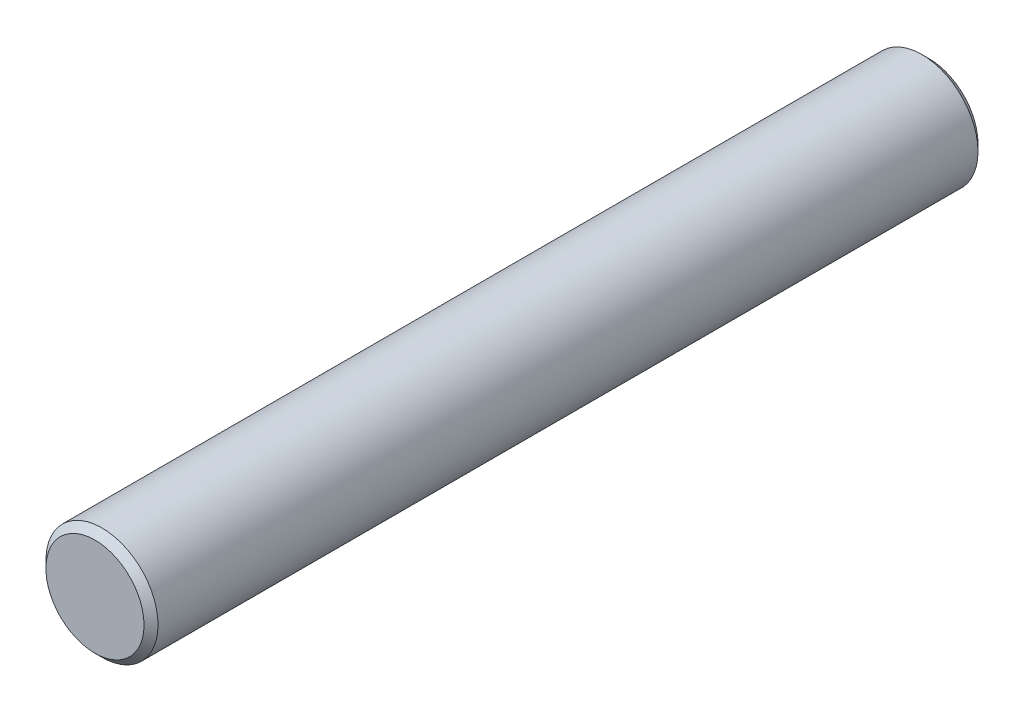
ISO-10303-21;
HEADER;
FILE_DESCRIPTION(('STEP AP214'),'2;1');
FILE_NAME('part.step','',(''),(''),'','','');
FILE_SCHEMA(('AUTOMOTIVE_DESIGN { 1 0 10303 214 1 1 1 1 }'));
ENDSEC;
DATA;
#1=APPLICATION_CONTEXT('core data for automotive mechanical design processes');
#2=APPLICATION_PROTOCOL_DEFINITION('international standard','automotive_design',2000,#1);
#3=PRODUCT_CONTEXT('',#1,'mechanical');
#4=PRODUCT('Part','Part','',(#3));
#5=PRODUCT_RELATED_PRODUCT_CATEGORY('part','',(#4));
#6=PRODUCT_DEFINITION_FORMATION('','',#4);
#7=PRODUCT_DEFINITION_CONTEXT('part definition',#1,'design');
#8=PRODUCT_DEFINITION('design','',#6,#7);
#9=PRODUCT_DEFINITION_SHAPE('','',#8);
#10=(LENGTH_UNIT() NAMED_UNIT(*) SI_UNIT(.MILLI.,.METRE.));
#11=(NAMED_UNIT(*) PLANE_ANGLE_UNIT() SI_UNIT($,.RADIAN.));
#12=(NAMED_UNIT(*) SI_UNIT($,.STERADIAN.) SOLID_ANGLE_UNIT());
#13=UNCERTAINTY_MEASURE_WITH_UNIT(LENGTH_MEASURE(1.E-05),#10,'distance_accuracy_value','');
#14=(GEOMETRIC_REPRESENTATION_CONTEXT(3) GLOBAL_UNCERTAINTY_ASSIGNED_CONTEXT((#13)) GLOBAL_UNIT_ASSIGNED_CONTEXT((#10,
#11,#12)) REPRESENTATION_CONTEXT('',''));
#15=CARTESIAN_POINT('',(0.,0.,0.));
#16=DIRECTION('',(0.,0.,1.));
#17=DIRECTION('',(1.,0.,0.));
#18=AXIS2_PLACEMENT_3D('',#15,#16,#17);
#19=CARTESIAN_POINT('',(0.,0.,59.5));
#20=DIRECTION('',(0.,0.,-1.));
#21=DIRECTION('',(-1.,0.,0.));
#22=AXIS2_PLACEMENT_3D('',#19,#20,#21);
#23=CYLINDRICAL_SURFACE('',#22,8.);
#24=CARTESIAN_POINT('',(0.,0.,-58.5));
#25=DIRECTION('',(0.,0.,1.));
#26=DIRECTION('',(1.,0.,0.));
#27=AXIS2_PLACEMENT_3D('',#24,#25,#26);
#28=CIRCLE('',#27,8.);
#29=CARTESIAN_POINT('',(8.,0.,-58.5));
#30=VERTEX_POINT('',#29);
#31=EDGE_CURVE('E50',#30,#30,#28,.T.);
#32=ORIENTED_EDGE('',*,*,#31,.T.);
#33=EDGE_LOOP('',(#32));
#34=FACE_BOUND('',#33,.T.);
#35=CARTESIAN_POINT('',(0.,0.,58.5));
#36=DIRECTION('',(0.,0.,1.));
#37=DIRECTION('',(1.,0.,0.));
#38=AXIS2_PLACEMENT_3D('',#35,#36,#37);
#39=CIRCLE('',#38,8.);
#40=CARTESIAN_POINT('',(8.,0.,58.5));
#41=VERTEX_POINT('',#40);
#42=EDGE_CURVE('E55',#41,#41,#39,.F.);
#43=ORIENTED_EDGE('',*,*,#42,.T.);
#44=EDGE_LOOP('',(#43));
#45=FACE_BOUND('',#44,.T.);
#46=ADVANCED_FACE('F37',(#34,#45),#23,.T.);
#47=CARTESIAN_POINT('',(0.,0.,59.5));
#48=DIRECTION('',(0.,0.,1.));
#49=DIRECTION('',(1.,0.,0.));
#50=AXIS2_PLACEMENT_3D('',#47,#48,#49);
#51=PLANE('',#50);
#52=CARTESIAN_POINT('',(0.,0.,59.5));
#53=DIRECTION('',(0.,0.,1.));
#54=DIRECTION('',(1.,0.,0.));
#55=AXIS2_PLACEMENT_3D('',#52,#53,#54);
#56=CIRCLE('',#55,6.99999999999998);
#57=CARTESIAN_POINT('',(6.99999999999998,0.,59.5));
#58=VERTEX_POINT('',#57);
#59=EDGE_CURVE('E10',#58,#58,#56,.T.);
#60=ORIENTED_EDGE('',*,*,#59,.T.);
#61=EDGE_LOOP('',(#60));
#62=FACE_BOUND('',#61,.T.);
#63=ADVANCED_FACE('F72',(#62),#51,.T.);
#64=CARTESIAN_POINT('',(0.,0.,-59.5));
#65=DIRECTION('',(0.,0.,1.));
#66=DIRECTION('',(1.,0.,0.));
#67=AXIS2_PLACEMENT_3D('',#64,#65,#66);
#68=PLANE('',#67);
#69=CARTESIAN_POINT('',(0.,0.,-59.5));
#70=DIRECTION('',(0.,0.,1.));
#71=DIRECTION('',(1.,0.,0.));
#72=AXIS2_PLACEMENT_3D('',#69,#70,#71);
#73=CIRCLE('',#72,7.00000000000002);
#74=CARTESIAN_POINT('',(7.00000000000002,0.,-59.5));
#75=VERTEX_POINT('',#74);
#76=EDGE_CURVE('E45',#75,#75,#73,.F.);
#77=ORIENTED_EDGE('',*,*,#76,.T.);
#78=EDGE_LOOP('',(#77));
#79=FACE_BOUND('',#78,.T.);
#80=ADVANCED_FACE('F69',(#79),#68,.F.);
#81=CARTESIAN_POINT('',(0.,0.,-58.5));
#82=DIRECTION('',(0.,0.,1.));
#83=DIRECTION('',(1.,0.,0.));
#84=AXIS2_PLACEMENT_3D('',#81,#82,#83);
#85=CONICAL_SURFACE('',#84,8.,0.785398163397452);
#86=ORIENTED_EDGE('',*,*,#76,.F.);
#87=EDGE_LOOP('',(#86));
#88=FACE_BOUND('',#87,.T.);
#89=ORIENTED_EDGE('',*,*,#31,.F.);
#90=EDGE_LOOP('',(#89));
#91=FACE_BOUND('',#90,.T.);
#92=ADVANCED_FACE('F65',(#88,#91),#85,.T.);
#93=CARTESIAN_POINT('',(0.,0.,59.5));
#94=DIRECTION('',(0.,0.,-1.));
#95=DIRECTION('',(-1.,0.,0.));
#96=AXIS2_PLACEMENT_3D('',#93,#94,#95);
#97=CONICAL_SURFACE('',#96,6.99999999999998,0.785398163397448);
#98=ORIENTED_EDGE('',*,*,#42,.F.);
#99=EDGE_LOOP('',(#98));
#100=FACE_BOUND('',#99,.T.);
#101=ORIENTED_EDGE('',*,*,#59,.F.);
#102=EDGE_LOOP('',(#101));
#103=FACE_BOUND('',#102,.T.);
#104=ADVANCED_FACE('F39',(#100,#103),#97,.T.);
#105=CLOSED_SHELL('',(#46,#63,#80,#92,#104));
#106=MANIFOLD_SOLID_BREP('B2',#105);
#107=ADVANCED_BREP_SHAPE_REPRESENTATION('',(#18,#106),#14);
#108=SHAPE_DEFINITION_REPRESENTATION(#9,#107);
ENDSEC;
END-ISO-10303-21;
